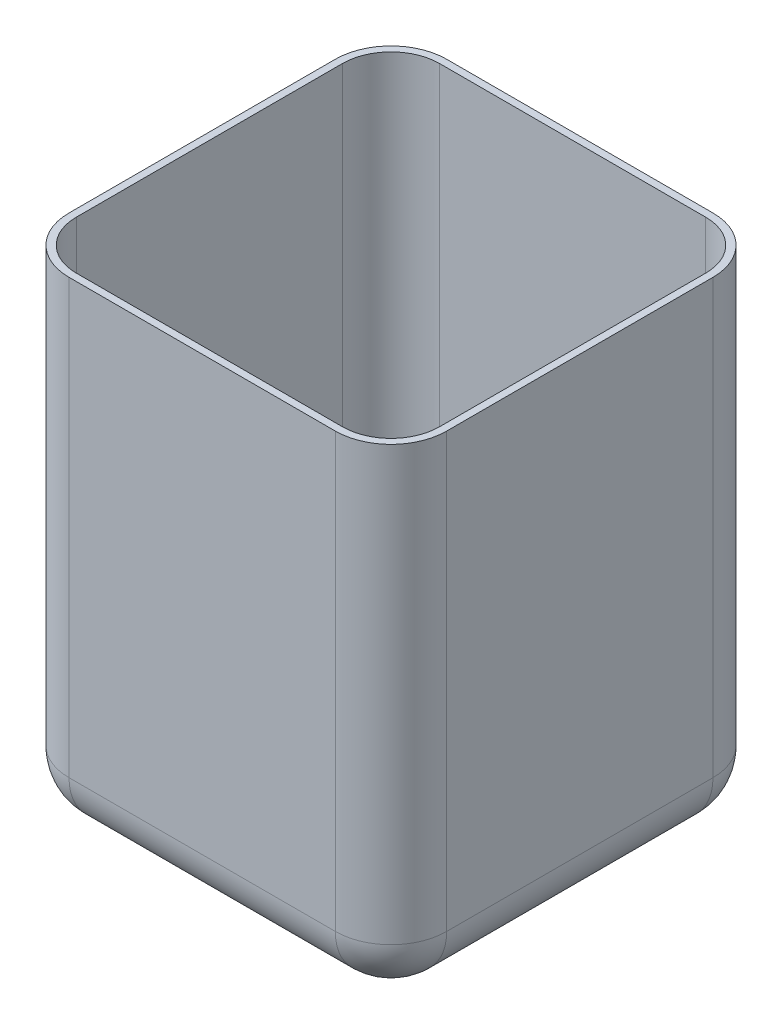
ISO-10303-21;
HEADER;
FILE_DESCRIPTION(('STEP AP214'),'2;1');
FILE_NAME('part.step','',(''),(''),'','','');
FILE_SCHEMA(('AUTOMOTIVE_DESIGN { 1 0 10303 214 1 1 1 1 }'));
ENDSEC;
DATA;
#1=APPLICATION_CONTEXT('core data for automotive mechanical design processes');
#2=APPLICATION_PROTOCOL_DEFINITION('international standard','automotive_design',2000,#1);
#3=PRODUCT_CONTEXT('',#1,'mechanical');
#4=PRODUCT('Part','Part','',(#3));
#5=PRODUCT_RELATED_PRODUCT_CATEGORY('part','',(#4));
#6=PRODUCT_DEFINITION_FORMATION('','',#4);
#7=PRODUCT_DEFINITION_CONTEXT('part definition',#1,'design');
#8=PRODUCT_DEFINITION('design','',#6,#7);
#9=PRODUCT_DEFINITION_SHAPE('','',#8);
#10=(LENGTH_UNIT() NAMED_UNIT(*) SI_UNIT(.MILLI.,.METRE.));
#11=(NAMED_UNIT(*) PLANE_ANGLE_UNIT() SI_UNIT($,.RADIAN.));
#12=(NAMED_UNIT(*) SI_UNIT($,.STERADIAN.) SOLID_ANGLE_UNIT());
#13=UNCERTAINTY_MEASURE_WITH_UNIT(LENGTH_MEASURE(1.E-05),#10,'distance_accuracy_value','');
#14=(GEOMETRIC_REPRESENTATION_CONTEXT(3) GLOBAL_UNCERTAINTY_ASSIGNED_CONTEXT((#13)) GLOBAL_UNIT_ASSIGNED_CONTEXT((#10,
#11,#12)) REPRESENTATION_CONTEXT('',''));
#15=CARTESIAN_POINT('',(0.,0.,0.));
#16=DIRECTION('',(0.,0.,1.));
#17=DIRECTION('',(1.,0.,0.));
#18=AXIS2_PLACEMENT_3D('',#15,#16,#17);
#19=CARTESIAN_POINT('',(-69.2307692307693,202.,-55.390243902439));
#20=DIRECTION('',(1.,0.,0.));
#21=DIRECTION('',(0.,0.,-1.));
#22=AXIS2_PLACEMENT_3D('',#19,#20,#21);
#23=PLANE('',#22);
#24=DIRECTION('',(0.,0.,1.));
#25=VECTOR('',#24,1.);
#26=CARTESIAN_POINT('',(-69.2307692307693,202.,-55.390243902439));
#27=LINE('',#26,#25);
#28=CARTESIAN_POINT('',(-69.2307692307693,202.,-32.390243902439));
#29=VERTEX_POINT('',#28);
#30=CARTESIAN_POINT('',(-69.2307692307692,202.,77.609756097561));
#31=VERTEX_POINT('',#30);
#32=EDGE_CURVE('E327',#29,#31,#27,.T.);
#33=ORIENTED_EDGE('',*,*,#32,.F.);
#34=DIRECTION('',(0.,-1.,0.));
#35=VECTOR('',#34,1.);
#36=CARTESIAN_POINT('',(-69.2307692307693,202.,-32.390243902439));
#37=LINE('',#36,#35);
#38=CARTESIAN_POINT('',(-69.2307692307693,23.,-32.390243902439));
#39=VERTEX_POINT('',#38);
#40=EDGE_CURVE('E71',#29,#39,#37,.T.);
#41=ORIENTED_EDGE('',*,*,#40,.T.);
#42=DIRECTION('',(0.,0.,1.));
#43=VECTOR('',#42,1.);
#44=CARTESIAN_POINT('',(-69.2307692307693,23.,-55.390243902439));
#45=LINE('',#44,#43);
#46=CARTESIAN_POINT('',(-69.2307692307692,23.,77.609756097561));
#47=VERTEX_POINT('',#46);
#48=EDGE_CURVE('E387',#39,#47,#45,.T.);
#49=ORIENTED_EDGE('',*,*,#48,.T.);
#50=DIRECTION('',(0.,-1.,0.));
#51=VECTOR('',#50,1.);
#52=CARTESIAN_POINT('',(-69.2307692307692,202.,77.609756097561));
#53=LINE('',#52,#51);
#54=EDGE_CURVE('E384',#47,#31,#53,.F.);
#55=ORIENTED_EDGE('',*,*,#54,.T.);
#56=EDGE_LOOP('',(#33,#41,#49,#55));
#57=FACE_BOUND('',#56,.T.);
#58=ADVANCED_FACE('F45',(#57),#23,.F.);
#59=CARTESIAN_POINT('',(-69.2307692307692,202.,100.609756097561));
#60=DIRECTION('',(0.,0.,-1.));
#61=DIRECTION('',(-1.,0.,0.));
#62=AXIS2_PLACEMENT_3D('',#59,#60,#61);
#63=PLANE('',#62);
#64=DIRECTION('',(1.,0.,0.));
#65=VECTOR('',#64,1.);
#66=CARTESIAN_POINT('',(-69.2307692307692,23.,100.609756097561));
#67=LINE('',#66,#65);
#68=CARTESIAN_POINT('',(-46.2307692307692,23.,100.609756097561));
#69=VERTEX_POINT('',#68);
#70=CARTESIAN_POINT('',(63.7692307692308,23.,100.609756097561));
#71=VERTEX_POINT('',#70);
#72=EDGE_CURVE('E346',#69,#71,#67,.T.);
#73=ORIENTED_EDGE('',*,*,#72,.T.);
#74=DIRECTION('',(0.,-1.,0.));
#75=VECTOR('',#74,1.);
#76=CARTESIAN_POINT('',(63.7692307692308,202.,100.609756097561));
#77=LINE('',#76,#75);
#78=CARTESIAN_POINT('',(63.7692307692308,202.,100.609756097561));
#79=VERTEX_POINT('',#78);
#80=EDGE_CURVE('E350',#71,#79,#77,.F.);
#81=ORIENTED_EDGE('',*,*,#80,.T.);
#82=DIRECTION('',(1.,0.,0.));
#83=VECTOR('',#82,1.);
#84=CARTESIAN_POINT('',(-69.2307692307692,202.,100.609756097561));
#85=LINE('',#84,#83);
#86=CARTESIAN_POINT('',(-46.2307692307692,202.,100.609756097561));
#87=VERTEX_POINT('',#86);
#88=EDGE_CURVE('E331',#87,#79,#85,.T.);
#89=ORIENTED_EDGE('',*,*,#88,.F.);
#90=DIRECTION('',(0.,-1.,0.));
#91=VECTOR('',#90,1.);
#92=CARTESIAN_POINT('',(-46.2307692307692,202.,100.609756097561));
#93=LINE('',#92,#91);
#94=EDGE_CURVE('E343',#87,#69,#93,.T.);
#95=ORIENTED_EDGE('',*,*,#94,.T.);
#96=EDGE_LOOP('',(#73,#81,#89,#95));
#97=FACE_BOUND('',#96,.T.);
#98=ADVANCED_FACE('F465',(#97),#63,.F.);
#99=CARTESIAN_POINT('',(86.7692307692307,202.,-55.390243902439));
#100=DIRECTION('',(-1.,0.,0.));
#101=DIRECTION('',(0.,0.,1.));
#102=AXIS2_PLACEMENT_3D('',#99,#100,#101);
#103=PLANE('',#102);
#104=DIRECTION('',(0.,0.,-1.));
#105=VECTOR('',#104,1.);
#106=CARTESIAN_POINT('',(86.7692307692307,23.,-55.390243902439));
#107=LINE('',#106,#105);
#108=CARTESIAN_POINT('',(86.7692307692308,23.,77.609756097561));
#109=VERTEX_POINT('',#108);
#110=CARTESIAN_POINT('',(86.7692307692307,23.,-32.390243902439));
#111=VERTEX_POINT('',#110);
#112=EDGE_CURVE('E369',#109,#111,#107,.T.);
#113=ORIENTED_EDGE('',*,*,#112,.T.);
#114=DIRECTION('',(0.,-1.,0.));
#115=VECTOR('',#114,1.);
#116=CARTESIAN_POINT('',(86.7692307692307,202.,-32.390243902439));
#117=LINE('',#116,#115);
#118=CARTESIAN_POINT('',(86.7692307692307,202.,-32.390243902439));
#119=VERTEX_POINT('',#118);
#120=EDGE_CURVE('E372',#111,#119,#117,.F.);
#121=ORIENTED_EDGE('',*,*,#120,.T.);
#122=DIRECTION('',(0.,0.,-1.));
#123=VECTOR('',#122,1.);
#124=CARTESIAN_POINT('',(86.7692307692307,202.,-55.390243902439));
#125=LINE('',#124,#123);
#126=CARTESIAN_POINT('',(86.7692307692308,202.,77.609756097561));
#127=VERTEX_POINT('',#126);
#128=EDGE_CURVE('E335',#127,#119,#125,.T.);
#129=ORIENTED_EDGE('',*,*,#128,.F.);
#130=DIRECTION('',(0.,-1.,0.));
#131=VECTOR('',#130,1.);
#132=CARTESIAN_POINT('',(86.7692307692308,202.,77.609756097561));
#133=LINE('',#132,#131);
#134=EDGE_CURVE('E366',#127,#109,#133,.T.);
#135=ORIENTED_EDGE('',*,*,#134,.T.);
#136=EDGE_LOOP('',(#113,#121,#129,#135));
#137=FACE_BOUND('',#136,.T.);
#138=ADVANCED_FACE('F475',(#137),#103,.F.);
#139=CARTESIAN_POINT('',(-69.2307692307693,202.,-55.390243902439));
#140=DIRECTION('',(0.,0.,1.));
#141=DIRECTION('',(1.,0.,0.));
#142=AXIS2_PLACEMENT_3D('',#139,#140,#141);
#143=PLANE('',#142);
#144=DIRECTION('',(-1.,0.,0.));
#145=VECTOR('',#144,1.);
#146=CARTESIAN_POINT('',(-69.2307692307693,202.,-55.390243902439));
#147=LINE('',#146,#145);
#148=CARTESIAN_POINT('',(63.7692307692308,202.,-55.390243902439));
#149=VERTEX_POINT('',#148);
#150=CARTESIAN_POINT('',(-46.2307692307692,202.,-55.390243902439));
#151=VERTEX_POINT('',#150);
#152=EDGE_CURVE('E339',#149,#151,#147,.T.);
#153=ORIENTED_EDGE('',*,*,#152,.F.);
#154=DIRECTION('',(0.,-1.,0.));
#155=VECTOR('',#154,1.);
#156=CARTESIAN_POINT('',(63.7692307692308,202.,-55.390243902439));
#157=LINE('',#156,#155);
#158=CARTESIAN_POINT('',(63.7692307692308,23.,-55.390243902439));
#159=VERTEX_POINT('',#158);
#160=EDGE_CURVE('E381',#149,#159,#157,.T.);
#161=ORIENTED_EDGE('',*,*,#160,.T.);
#162=DIRECTION('',(-1.,0.,0.));
#163=VECTOR('',#162,1.);
#164=CARTESIAN_POINT('',(-69.2307692307693,23.,-55.390243902439));
#165=LINE('',#164,#163);
#166=CARTESIAN_POINT('',(-46.2307692307692,23.,-55.390243902439));
#167=VERTEX_POINT('',#166);
#168=EDGE_CURVE('E378',#159,#167,#165,.T.);
#169=ORIENTED_EDGE('',*,*,#168,.T.);
#170=DIRECTION('',(0.,-1.,0.));
#171=VECTOR('',#170,1.);
#172=CARTESIAN_POINT('',(-46.2307692307692,202.,-55.390243902439));
#173=LINE('',#172,#171);
#174=EDGE_CURVE('E375',#167,#151,#173,.F.);
#175=ORIENTED_EDGE('',*,*,#174,.T.);
#176=EDGE_LOOP('',(#153,#161,#169,#175));
#177=FACE_BOUND('',#176,.T.);
#178=ADVANCED_FACE('F497',(#177),#143,.F.);
#179=CARTESIAN_POINT('',(0.,202.,0.));
#180=DIRECTION('',(0.,1.,0.));
#181=DIRECTION('',(0.,0.,1.));
#182=AXIS2_PLACEMENT_3D('',#179,#180,#181);
#183=PLANE('',#182);
#184=DIRECTION('',(0.,0.,-1.));
#185=VECTOR('',#184,1.);
#186=CARTESIAN_POINT('',(83.7692307692307,202.,-55.390243902439));
#187=LINE('',#186,#185);
#188=CARTESIAN_POINT('',(83.7692307692308,202.,77.609756097561));
#189=VERTEX_POINT('',#188);
#190=CARTESIAN_POINT('',(83.7692307692307,202.,-32.390243902439));
#191=VERTEX_POINT('',#190);
#192=EDGE_CURVE('E312',#189,#191,#187,.T.);
#193=ORIENTED_EDGE('',*,*,#192,.F.);
#194=CARTESIAN_POINT('',(63.7692307692308,202.,77.609756097561));
#195=DIRECTION('',(0.,1.,0.));
#196=DIRECTION('',(0.,0.,1.));
#197=AXIS2_PLACEMENT_3D('',#194,#195,#196);
#198=CIRCLE('',#197,20.);
#199=CARTESIAN_POINT('',(63.7692307692308,202.,97.6097560975609));
#200=VERTEX_POINT('',#199);
#201=EDGE_CURVE('E309',#200,#189,#198,.T.);
#202=ORIENTED_EDGE('',*,*,#201,.F.);
#203=DIRECTION('',(1.,0.,0.));
#204=VECTOR('',#203,1.);
#205=CARTESIAN_POINT('',(-69.2307692307692,202.,97.6097560975609));
#206=LINE('',#205,#204);
#207=CARTESIAN_POINT('',(-46.2307692307692,202.,97.6097560975609));
#208=VERTEX_POINT('',#207);
#209=EDGE_CURVE('E63',#208,#200,#206,.T.);
#210=ORIENTED_EDGE('',*,*,#209,.F.);
#211=CARTESIAN_POINT('',(-46.2307692307692,202.,77.609756097561));
#212=DIRECTION('',(0.,1.,0.));
#213=DIRECTION('',(0.,0.,1.));
#214=AXIS2_PLACEMENT_3D('',#211,#212,#213);
#215=CIRCLE('',#214,20.);
#216=CARTESIAN_POINT('',(-66.2307692307692,202.,77.609756097561));
#217=VERTEX_POINT('',#216);
#218=EDGE_CURVE('E198',#217,#208,#215,.T.);
#219=ORIENTED_EDGE('',*,*,#218,.F.);
#220=DIRECTION('',(0.,0.,1.));
#221=VECTOR('',#220,1.);
#222=CARTESIAN_POINT('',(-66.2307692307692,202.,-55.390243902439));
#223=LINE('',#222,#221);
#224=CARTESIAN_POINT('',(-66.2307692307692,202.,-32.390243902439));
#225=VERTEX_POINT('',#224);
#226=EDGE_CURVE('E273',#225,#217,#223,.T.);
#227=ORIENTED_EDGE('',*,*,#226,.F.);
#228=CARTESIAN_POINT('',(-46.2307692307692,202.,-32.390243902439));
#229=DIRECTION('',(0.,1.,0.));
#230=DIRECTION('',(0.,0.,1.));
#231=AXIS2_PLACEMENT_3D('',#228,#229,#230);
#232=CIRCLE('',#231,20.);
#233=CARTESIAN_POINT('',(-46.2307692307692,202.,-52.390243902439));
#234=VERTEX_POINT('',#233);
#235=EDGE_CURVE('E192',#234,#225,#232,.T.);
#236=ORIENTED_EDGE('',*,*,#235,.F.);
#237=DIRECTION('',(-1.,0.,0.));
#238=VECTOR('',#237,1.);
#239=CARTESIAN_POINT('',(-69.2307692307693,202.,-52.390243902439));
#240=LINE('',#239,#238);
#241=CARTESIAN_POINT('',(63.7692307692308,202.,-52.390243902439));
#242=VERTEX_POINT('',#241);
#243=EDGE_CURVE('E286',#242,#234,#240,.T.);
#244=ORIENTED_EDGE('',*,*,#243,.F.);
#245=CARTESIAN_POINT('',(63.7692307692308,202.,-32.390243902439));
#246=DIRECTION('',(0.,1.,0.));
#247=DIRECTION('',(0.,0.,1.));
#248=AXIS2_PLACEMENT_3D('',#245,#246,#247);
#249=CIRCLE('',#248,20.);
#250=EDGE_CURVE('E318',#191,#242,#249,.T.);
#251=ORIENTED_EDGE('',*,*,#250,.F.);
#252=EDGE_LOOP('',(#193,#202,#210,#219,#227,#236,#244,#251));
#253=FACE_BOUND('',#252,.T.);
#254=ORIENTED_EDGE('',*,*,#128,.T.);
#255=CARTESIAN_POINT('',(63.7692307692308,202.,-32.390243902439));
#256=DIRECTION('',(0.,1.,0.));
#257=DIRECTION('',(0.,0.,1.));
#258=AXIS2_PLACEMENT_3D('',#255,#256,#257);
#259=CIRCLE('',#258,23.);
#260=EDGE_CURVE('E11',#119,#149,#259,.T.);
#261=ORIENTED_EDGE('',*,*,#260,.T.);
#262=ORIENTED_EDGE('',*,*,#152,.T.);
#263=CARTESIAN_POINT('',(-46.2307692307692,202.,-32.390243902439));
#264=DIRECTION('',(0.,1.,0.));
#265=DIRECTION('',(0.,0.,1.));
#266=AXIS2_PLACEMENT_3D('',#263,#264,#265);
#267=CIRCLE('',#266,23.);
#268=EDGE_CURVE('E55',#151,#29,#267,.T.);
#269=ORIENTED_EDGE('',*,*,#268,.T.);
#270=ORIENTED_EDGE('',*,*,#32,.T.);
#271=CARTESIAN_POINT('',(-46.2307692307692,202.,77.609756097561));
#272=DIRECTION('',(0.,1.,0.));
#273=DIRECTION('',(0.,0.,1.));
#274=AXIS2_PLACEMENT_3D('',#271,#272,#273);
#275=CIRCLE('',#274,23.);
#276=EDGE_CURVE('E392',#31,#87,#275,.T.);
#277=ORIENTED_EDGE('',*,*,#276,.T.);
#278=ORIENTED_EDGE('',*,*,#88,.T.);
#279=CARTESIAN_POINT('',(63.7692307692308,202.,77.609756097561));
#280=DIRECTION('',(0.,1.,0.));
#281=DIRECTION('',(0.,0.,1.));
#282=AXIS2_PLACEMENT_3D('',#279,#280,#281);
#283=CIRCLE('',#282,23.);
#284=EDGE_CURVE('E395',#79,#127,#283,.T.);
#285=ORIENTED_EDGE('',*,*,#284,.T.);
#286=EDGE_LOOP('',(#254,#261,#262,#269,#270,#277,#278,#285));
#287=FACE_BOUND('',#286,.T.);
#288=ADVANCED_FACE('F462',(#253,#287),#183,.T.);
#289=CARTESIAN_POINT('',(0.,0.,0.));
#290=DIRECTION('',(0.,1.,0.));
#291=DIRECTION('',(0.,0.,1.));
#292=AXIS2_PLACEMENT_3D('',#289,#290,#291);
#293=PLANE('',#292);
#294=DIRECTION('',(0.,0.,-1.));
#295=VECTOR('',#294,1.);
#296=CARTESIAN_POINT('',(63.7692307692307,0.,0.));
#297=LINE('',#296,#295);
#298=CARTESIAN_POINT('',(63.7692307692307,0.,-32.390243902439));
#299=VERTEX_POINT('',#298);
#300=CARTESIAN_POINT('',(63.7692307692308,0.,77.609756097561));
#301=VERTEX_POINT('',#300);
#302=EDGE_CURVE('E359',#299,#301,#297,.F.);
#303=ORIENTED_EDGE('',*,*,#302,.T.);
#304=DIRECTION('',(1.,0.,0.));
#305=VECTOR('',#304,1.);
#306=CARTESIAN_POINT('',(0.,0.,77.609756097561));
#307=LINE('',#306,#305);
#308=CARTESIAN_POINT('',(-46.2307692307692,0.,77.609756097561));
#309=VERTEX_POINT('',#308);
#310=EDGE_CURVE('E362',#301,#309,#307,.F.);
#311=ORIENTED_EDGE('',*,*,#310,.T.);
#312=DIRECTION('',(0.,0.,1.));
#313=VECTOR('',#312,1.);
#314=CARTESIAN_POINT('',(-46.2307692307692,0.,0.));
#315=LINE('',#314,#313);
#316=CARTESIAN_POINT('',(-46.2307692307692,0.,-32.390243902439));
#317=VERTEX_POINT('',#316);
#318=EDGE_CURVE('E353',#309,#317,#315,.F.);
#319=ORIENTED_EDGE('',*,*,#318,.T.);
#320=DIRECTION('',(-1.,0.,0.));
#321=VECTOR('',#320,1.);
#322=CARTESIAN_POINT('',(0.,0.,-32.390243902439));
#323=LINE('',#322,#321);
#324=EDGE_CURVE('E356',#317,#299,#323,.F.);
#325=ORIENTED_EDGE('',*,*,#324,.T.);
#326=EDGE_LOOP('',(#303,#311,#319,#325));
#327=FACE_BOUND('',#326,.T.);
#328=ADVANCED_FACE('F492',(#327),#293,.F.);
#329=CARTESIAN_POINT('',(-46.2307692307692,202.,-32.390243902439));
#330=DIRECTION('',(0.,-1.,0.));
#331=DIRECTION('',(0.,0.,-1.));
#332=AXIS2_PLACEMENT_3D('',#329,#330,#331);
#333=CYLINDRICAL_SURFACE('',#332,23.);
#334=ORIENTED_EDGE('',*,*,#268,.F.);
#335=ORIENTED_EDGE('',*,*,#174,.F.);
#336=CARTESIAN_POINT('',(-46.2307692307692,23.,-32.390243902439));
#337=DIRECTION('',(0.,-1.,0.));
#338=DIRECTION('',(0.,0.,-1.));
#339=AXIS2_PLACEMENT_3D('',#336,#337,#338);
#340=CIRCLE('',#339,23.);
#341=EDGE_CURVE('E436',#39,#167,#340,.T.);
#342=ORIENTED_EDGE('',*,*,#341,.F.);
#343=ORIENTED_EDGE('',*,*,#40,.F.);
#344=EDGE_LOOP('',(#334,#335,#342,#343));
#345=FACE_BOUND('',#344,.T.);
#346=ADVANCED_FACE('F47',(#345),#333,.T.);
#347=CARTESIAN_POINT('',(63.7692307692308,202.,-32.390243902439));
#348=DIRECTION('',(0.,-1.,0.));
#349=DIRECTION('',(0.,0.,-1.));
#350=AXIS2_PLACEMENT_3D('',#347,#348,#349);
#351=CYLINDRICAL_SURFACE('',#350,23.);
#352=ORIENTED_EDGE('',*,*,#260,.F.);
#353=ORIENTED_EDGE('',*,*,#120,.F.);
#354=CARTESIAN_POINT('',(63.7692307692308,23.,-32.390243902439));
#355=DIRECTION('',(0.,-1.,0.));
#356=DIRECTION('',(0.,0.,-1.));
#357=AXIS2_PLACEMENT_3D('',#354,#355,#356);
#358=CIRCLE('',#357,23.);
#359=EDGE_CURVE('E433',#159,#111,#358,.T.);
#360=ORIENTED_EDGE('',*,*,#359,.F.);
#361=ORIENTED_EDGE('',*,*,#160,.F.);
#362=EDGE_LOOP('',(#352,#353,#360,#361));
#363=FACE_BOUND('',#362,.T.);
#364=ADVANCED_FACE('F480',(#363),#351,.T.);
#365=CARTESIAN_POINT('',(-69.2307692307693,23.,-32.390243902439));
#366=DIRECTION('',(-1.,0.,0.));
#367=DIRECTION('',(0.,0.,1.));
#368=AXIS2_PLACEMENT_3D('',#365,#366,#367);
#369=CYLINDRICAL_SURFACE('',#368,23.);
#370=CARTESIAN_POINT('',(-46.2307692307692,23.,-32.390243902439));
#371=DIRECTION('',(-1.,0.,0.));
#372=DIRECTION('',(0.,0.,1.));
#373=AXIS2_PLACEMENT_3D('',#370,#371,#372);
#374=CIRCLE('',#373,23.);
#375=EDGE_CURVE('E49',#167,#317,#374,.T.);
#376=ORIENTED_EDGE('',*,*,#375,.F.);
#377=ORIENTED_EDGE('',*,*,#168,.F.);
#378=CARTESIAN_POINT('',(63.7692307692307,23.,-32.390243902439));
#379=DIRECTION('',(1.,0.,0.));
#380=DIRECTION('',(0.,0.,-1.));
#381=AXIS2_PLACEMENT_3D('',#378,#379,#380);
#382=CIRCLE('',#381,23.);
#383=EDGE_CURVE('E429',#299,#159,#382,.T.);
#384=ORIENTED_EDGE('',*,*,#383,.F.);
#385=ORIENTED_EDGE('',*,*,#324,.F.);
#386=EDGE_LOOP('',(#376,#377,#384,#385));
#387=FACE_BOUND('',#386,.T.);
#388=ADVANCED_FACE('F493',(#387),#369,.T.);
#389=CARTESIAN_POINT('',(-46.2307692307692,23.,-32.390243902439));
#390=DIRECTION('',(0.,0.,-1.));
#391=DIRECTION('',(0.,1.,0.));
#392=AXIS2_PLACEMENT_3D('',#389,#390,#391);
#393=SPHERICAL_SURFACE('',#392,23.);
#394=ORIENTED_EDGE('',*,*,#341,.T.);
#395=ORIENTED_EDGE('',*,*,#375,.T.);
#396=CARTESIAN_POINT('',(-46.2307692307692,23.,-32.390243902439));
#397=DIRECTION('',(0.,0.,-1.));
#398=DIRECTION('',(-1.,0.,0.));
#399=AXIS2_PLACEMENT_3D('',#396,#397,#398);
#400=CIRCLE('',#399,23.);
#401=EDGE_CURVE('E425',#39,#317,#400,.F.);
#402=ORIENTED_EDGE('',*,*,#401,.F.);
#403=EDGE_LOOP('',(#394,#395,#402));
#404=FACE_BOUND('',#403,.T.);
#405=ADVANCED_FACE('F444',(#404),#393,.T.);
#406=CARTESIAN_POINT('',(63.7692307692307,23.,-32.390243902439));
#407=DIRECTION('',(0.,0.,-1.));
#408=DIRECTION('',(-1.,0.,0.));
#409=AXIS2_PLACEMENT_3D('',#406,#407,#408);
#410=SPHERICAL_SURFACE('',#409,23.);
#411=ORIENTED_EDGE('',*,*,#383,.T.);
#412=ORIENTED_EDGE('',*,*,#359,.T.);
#413=CARTESIAN_POINT('',(63.7692307692307,23.,-32.390243902439));
#414=DIRECTION('',(0.,0.,-1.));
#415=DIRECTION('',(-1.,0.,0.));
#416=AXIS2_PLACEMENT_3D('',#413,#414,#415);
#417=CIRCLE('',#416,23.);
#418=EDGE_CURVE('E421',#299,#111,#417,.F.);
#419=ORIENTED_EDGE('',*,*,#418,.F.);
#420=EDGE_LOOP('',(#411,#412,#419));
#421=FACE_BOUND('',#420,.T.);
#422=ADVANCED_FACE('F484',(#421),#410,.T.);
#423=CARTESIAN_POINT('',(-46.2307692307692,23.,-55.390243902439));
#424=DIRECTION('',(0.,0.,1.));
#425=DIRECTION('',(1.,0.,0.));
#426=AXIS2_PLACEMENT_3D('',#423,#424,#425);
#427=CYLINDRICAL_SURFACE('',#426,23.);
#428=ORIENTED_EDGE('',*,*,#401,.T.);
#429=ORIENTED_EDGE('',*,*,#318,.F.);
#430=CARTESIAN_POINT('',(-46.2307692307692,23.,77.609756097561));
#431=DIRECTION('',(0.,0.,1.));
#432=DIRECTION('',(1.,0.,0.));
#433=AXIS2_PLACEMENT_3D('',#430,#431,#432);
#434=CIRCLE('',#433,23.);
#435=EDGE_CURVE('E417',#47,#309,#434,.T.);
#436=ORIENTED_EDGE('',*,*,#435,.F.);
#437=ORIENTED_EDGE('',*,*,#48,.F.);
#438=EDGE_LOOP('',(#428,#429,#436,#437));
#439=FACE_BOUND('',#438,.T.);
#440=ADVANCED_FACE('F451',(#439),#427,.T.);
#441=CARTESIAN_POINT('',(-46.2307692307692,202.,77.609756097561));
#442=DIRECTION('',(0.,-1.,0.));
#443=DIRECTION('',(0.,0.,-1.));
#444=AXIS2_PLACEMENT_3D('',#441,#442,#443);
#445=CYLINDRICAL_SURFACE('',#444,23.);
#446=ORIENTED_EDGE('',*,*,#276,.F.);
#447=ORIENTED_EDGE('',*,*,#54,.F.);
#448=CARTESIAN_POINT('',(-46.2307692307692,23.,77.609756097561));
#449=DIRECTION('',(0.,-1.,0.));
#450=DIRECTION('',(0.,0.,-1.));
#451=AXIS2_PLACEMENT_3D('',#448,#449,#450);
#452=CIRCLE('',#451,23.);
#453=EDGE_CURVE('E413',#69,#47,#452,.T.);
#454=ORIENTED_EDGE('',*,*,#453,.F.);
#455=ORIENTED_EDGE('',*,*,#94,.F.);
#456=EDGE_LOOP('',(#446,#447,#454,#455));
#457=FACE_BOUND('',#456,.T.);
#458=ADVANCED_FACE('F457',(#457),#445,.T.);
#459=CARTESIAN_POINT('',(63.7692307692308,202.,77.609756097561));
#460=DIRECTION('',(0.,-1.,0.));
#461=DIRECTION('',(0.,0.,-1.));
#462=AXIS2_PLACEMENT_3D('',#459,#460,#461);
#463=CYLINDRICAL_SURFACE('',#462,23.);
#464=ORIENTED_EDGE('',*,*,#284,.F.);
#465=ORIENTED_EDGE('',*,*,#80,.F.);
#466=CARTESIAN_POINT('',(63.7692307692308,23.,77.609756097561));
#467=DIRECTION('',(0.,-1.,0.));
#468=DIRECTION('',(0.,0.,-1.));
#469=AXIS2_PLACEMENT_3D('',#466,#467,#468);
#470=CIRCLE('',#469,23.);
#471=EDGE_CURVE('E409',#109,#71,#470,.T.);
#472=ORIENTED_EDGE('',*,*,#471,.F.);
#473=ORIENTED_EDGE('',*,*,#134,.F.);
#474=EDGE_LOOP('',(#464,#465,#472,#473));
#475=FACE_BOUND('',#474,.T.);
#476=ADVANCED_FACE('F470',(#475),#463,.T.);
#477=CARTESIAN_POINT('',(63.7692307692307,23.,-55.390243902439));
#478=DIRECTION('',(0.,0.,-1.));
#479=DIRECTION('',(-1.,0.,0.));
#480=AXIS2_PLACEMENT_3D('',#477,#478,#479);
#481=CYLINDRICAL_SURFACE('',#480,23.);
#482=ORIENTED_EDGE('',*,*,#418,.T.);
#483=ORIENTED_EDGE('',*,*,#112,.F.);
#484=CARTESIAN_POINT('',(63.7692307692308,23.,77.609756097561));
#485=DIRECTION('',(0.,0.,1.));
#486=DIRECTION('',(1.,0.,0.));
#487=AXIS2_PLACEMENT_3D('',#484,#485,#486);
#488=CIRCLE('',#487,23.);
#489=EDGE_CURVE('E405',#301,#109,#488,.T.);
#490=ORIENTED_EDGE('',*,*,#489,.F.);
#491=ORIENTED_EDGE('',*,*,#302,.F.);
#492=EDGE_LOOP('',(#482,#483,#490,#491));
#493=FACE_BOUND('',#492,.T.);
#494=ADVANCED_FACE('F488',(#493),#481,.T.);
#495=CARTESIAN_POINT('',(-46.2307692307692,23.,77.609756097561));
#496=DIRECTION('',(-1.,0.,0.));
#497=DIRECTION('',(0.,-1.,0.));
#498=AXIS2_PLACEMENT_3D('',#495,#496,#497);
#499=SPHERICAL_SURFACE('',#498,23.);
#500=ORIENTED_EDGE('',*,*,#453,.T.);
#501=ORIENTED_EDGE('',*,*,#435,.T.);
#502=CARTESIAN_POINT('',(-46.2307692307692,23.,77.609756097561));
#503=DIRECTION('',(-1.,0.,0.));
#504=DIRECTION('',(0.,0.,1.));
#505=AXIS2_PLACEMENT_3D('',#502,#503,#504);
#506=CIRCLE('',#505,23.);
#507=EDGE_CURVE('E402',#69,#309,#506,.F.);
#508=ORIENTED_EDGE('',*,*,#507,.F.);
#509=EDGE_LOOP('',(#500,#501,#508));
#510=FACE_BOUND('',#509,.T.);
#511=ADVANCED_FACE('F521',(#510),#499,.T.);
#512=CARTESIAN_POINT('',(63.7692307692308,23.,77.609756097561));
#513=DIRECTION('',(1.,0.,0.));
#514=DIRECTION('',(0.,1.,0.));
#515=AXIS2_PLACEMENT_3D('',#512,#513,#514);
#516=SPHERICAL_SURFACE('',#515,23.);
#517=ORIENTED_EDGE('',*,*,#489,.T.);
#518=ORIENTED_EDGE('',*,*,#471,.T.);
#519=CARTESIAN_POINT('',(63.7692307692308,23.,77.609756097561));
#520=DIRECTION('',(1.,0.,0.));
#521=DIRECTION('',(0.,0.,-1.));
#522=AXIS2_PLACEMENT_3D('',#519,#520,#521);
#523=CIRCLE('',#522,23.);
#524=EDGE_CURVE('E321',#301,#71,#523,.F.);
#525=ORIENTED_EDGE('',*,*,#524,.F.);
#526=EDGE_LOOP('',(#517,#518,#525));
#527=FACE_BOUND('',#526,.T.);
#528=ADVANCED_FACE('F517',(#527),#516,.T.);
#529=CARTESIAN_POINT('',(-69.2307692307692,23.,77.609756097561));
#530=DIRECTION('',(1.,0.,0.));
#531=DIRECTION('',(0.,0.,-1.));
#532=AXIS2_PLACEMENT_3D('',#529,#530,#531);
#533=CYLINDRICAL_SURFACE('',#532,23.);
#534=ORIENTED_EDGE('',*,*,#507,.T.);
#535=ORIENTED_EDGE('',*,*,#310,.F.);
#536=ORIENTED_EDGE('',*,*,#524,.T.);
#537=ORIENTED_EDGE('',*,*,#72,.F.);
#538=EDGE_LOOP('',(#534,#535,#536,#537));
#539=FACE_BOUND('',#538,.T.);
#540=ADVANCED_FACE('F514',(#539),#533,.T.);
#541=CARTESIAN_POINT('',(-66.2307692307692,202.,-55.390243902439));
#542=DIRECTION('',(1.,0.,0.));
#543=DIRECTION('',(0.,0.,-1.));
#544=AXIS2_PLACEMENT_3D('',#541,#542,#543);
#545=PLANE('',#544);
#546=ORIENTED_EDGE('',*,*,#226,.T.);
#547=DIRECTION('',(0.,1.,0.));
#548=VECTOR('',#547,1.);
#549=CARTESIAN_POINT('',(-66.2307692307692,202.,77.609756097561));
#550=LINE('',#549,#548);
#551=CARTESIAN_POINT('',(-66.2307692307692,23.,77.609756097561));
#552=VERTEX_POINT('',#551);
#553=EDGE_CURVE('E224',#552,#217,#550,.T.);
#554=ORIENTED_EDGE('',*,*,#553,.F.);
#555=DIRECTION('',(0.,0.,-1.));
#556=VECTOR('',#555,1.);
#557=CARTESIAN_POINT('',(-66.2307692307692,23.,-55.390243902439));
#558=LINE('',#557,#556);
#559=CARTESIAN_POINT('',(-66.2307692307692,23.,-32.390243902439));
#560=VERTEX_POINT('',#559);
#561=EDGE_CURVE('E199',#560,#552,#558,.F.);
#562=ORIENTED_EDGE('',*,*,#561,.F.);
#563=DIRECTION('',(0.,1.,0.));
#564=VECTOR('',#563,1.);
#565=CARTESIAN_POINT('',(-66.2307692307692,202.,-32.390243902439));
#566=LINE('',#565,#564);
#567=EDGE_CURVE('E187',#225,#560,#566,.F.);
#568=ORIENTED_EDGE('',*,*,#567,.F.);
#569=EDGE_LOOP('',(#546,#554,#562,#568));
#570=FACE_BOUND('',#569,.T.);
#571=ADVANCED_FACE('F223',(#570),#545,.T.);
#572=CARTESIAN_POINT('',(-69.2307692307692,202.,97.6097560975609));
#573=DIRECTION('',(0.,0.,-1.));
#574=DIRECTION('',(-1.,0.,0.));
#575=AXIS2_PLACEMENT_3D('',#572,#573,#574);
#576=PLANE('',#575);
#577=DIRECTION('',(-1.,0.,0.));
#578=VECTOR('',#577,1.);
#579=CARTESIAN_POINT('',(-69.2307692307692,23.,97.6097560975609));
#580=LINE('',#579,#578);
#581=CARTESIAN_POINT('',(-46.2307692307692,23.,97.6097560975609));
#582=VERTEX_POINT('',#581);
#583=CARTESIAN_POINT('',(63.7692307692308,23.,97.609756097561));
#584=VERTEX_POINT('',#583);
#585=EDGE_CURVE('E285',#582,#584,#580,.F.);
#586=ORIENTED_EDGE('',*,*,#585,.F.);
#587=DIRECTION('',(0.,1.,0.));
#588=VECTOR('',#587,1.);
#589=CARTESIAN_POINT('',(-46.2307692307692,202.,97.6097560975609));
#590=LINE('',#589,#588);
#591=EDGE_CURVE('E282',#208,#582,#590,.F.);
#592=ORIENTED_EDGE('',*,*,#591,.F.);
#593=ORIENTED_EDGE('',*,*,#209,.T.);
#594=DIRECTION('',(0.,1.,0.));
#595=VECTOR('',#594,1.);
#596=CARTESIAN_POINT('',(63.7692307692308,202.,97.6097560975609));
#597=LINE('',#596,#595);
#598=EDGE_CURVE('E269',#584,#200,#597,.T.);
#599=ORIENTED_EDGE('',*,*,#598,.F.);
#600=EDGE_LOOP('',(#586,#592,#593,#599));
#601=FACE_BOUND('',#600,.T.);
#602=ADVANCED_FACE('F586',(#601),#576,.T.);
#603=CARTESIAN_POINT('',(83.7692307692307,202.,-55.390243902439));
#604=DIRECTION('',(-1.,0.,0.));
#605=DIRECTION('',(0.,0.,1.));
#606=AXIS2_PLACEMENT_3D('',#603,#604,#605);
#607=PLANE('',#606);
#608=DIRECTION('',(0.,0.,1.));
#609=VECTOR('',#608,1.);
#610=CARTESIAN_POINT('',(83.7692307692307,23.,-55.390243902439));
#611=LINE('',#610,#609);
#612=CARTESIAN_POINT('',(83.7692307692308,23.,77.609756097561));
#613=VERTEX_POINT('',#612);
#614=CARTESIAN_POINT('',(83.7692307692307,23.,-32.390243902439));
#615=VERTEX_POINT('',#614);
#616=EDGE_CURVE('E243',#613,#615,#611,.F.);
#617=ORIENTED_EDGE('',*,*,#616,.F.);
#618=DIRECTION('',(0.,1.,0.));
#619=VECTOR('',#618,1.);
#620=CARTESIAN_POINT('',(83.7692307692308,202.,77.609756097561));
#621=LINE('',#620,#619);
#622=EDGE_CURVE('E249',#189,#613,#621,.F.);
#623=ORIENTED_EDGE('',*,*,#622,.F.);
#624=ORIENTED_EDGE('',*,*,#192,.T.);
#625=DIRECTION('',(0.,1.,0.));
#626=VECTOR('',#625,1.);
#627=CARTESIAN_POINT('',(83.7692307692307,202.,-32.390243902439));
#628=LINE('',#627,#626);
#629=EDGE_CURVE('E235',#615,#191,#628,.T.);
#630=ORIENTED_EDGE('',*,*,#629,.F.);
#631=EDGE_LOOP('',(#617,#623,#624,#630));
#632=FACE_BOUND('',#631,.T.);
#633=ADVANCED_FACE('F593',(#632),#607,.T.);
#634=CARTESIAN_POINT('',(-69.2307692307693,202.,-52.390243902439));
#635=DIRECTION('',(0.,0.,1.));
#636=DIRECTION('',(1.,0.,0.));
#637=AXIS2_PLACEMENT_3D('',#634,#635,#636);
#638=PLANE('',#637);
#639=ORIENTED_EDGE('',*,*,#243,.T.);
#640=DIRECTION('',(0.,1.,0.));
#641=VECTOR('',#640,1.);
#642=CARTESIAN_POINT('',(-46.2307692307692,202.,-52.390243902439));
#643=LINE('',#642,#641);
#644=CARTESIAN_POINT('',(-46.2307692307692,23.,-52.390243902439));
#645=VERTEX_POINT('',#644);
#646=EDGE_CURVE('E232',#645,#234,#643,.T.);
#647=ORIENTED_EDGE('',*,*,#646,.F.);
#648=DIRECTION('',(1.,0.,0.));
#649=VECTOR('',#648,1.);
#650=CARTESIAN_POINT('',(-69.2307692307693,23.,-52.390243902439));
#651=LINE('',#650,#649);
#652=CARTESIAN_POINT('',(63.7692307692308,23.,-52.390243902439));
#653=VERTEX_POINT('',#652);
#654=EDGE_CURVE('E234',#653,#645,#651,.F.);
#655=ORIENTED_EDGE('',*,*,#654,.F.);
#656=DIRECTION('',(0.,1.,0.));
#657=VECTOR('',#656,1.);
#658=CARTESIAN_POINT('',(63.7692307692308,202.,-52.390243902439));
#659=LINE('',#658,#657);
#660=EDGE_CURVE('E229',#242,#653,#659,.F.);
#661=ORIENTED_EDGE('',*,*,#660,.F.);
#662=EDGE_LOOP('',(#639,#647,#655,#661));
#663=FACE_BOUND('',#662,.T.);
#664=ADVANCED_FACE('F600',(#663),#638,.T.);
#665=CARTESIAN_POINT('',(0.,3.,0.));
#666=DIRECTION('',(0.,1.,0.));
#667=DIRECTION('',(0.,0.,1.));
#668=AXIS2_PLACEMENT_3D('',#665,#666,#667);
#669=PLANE('',#668);
#670=DIRECTION('',(0.,0.,1.));
#671=VECTOR('',#670,1.);
#672=CARTESIAN_POINT('',(63.7692307692307,3.,0.));
#673=LINE('',#672,#671);
#674=CARTESIAN_POINT('',(63.7692307692307,3.,-32.390243902439));
#675=VERTEX_POINT('',#674);
#676=CARTESIAN_POINT('',(63.7692307692308,3.,77.609756097561));
#677=VERTEX_POINT('',#676);
#678=EDGE_CURVE('E260',#675,#677,#673,.T.);
#679=ORIENTED_EDGE('',*,*,#678,.F.);
#680=DIRECTION('',(1.,0.,0.));
#681=VECTOR('',#680,1.);
#682=CARTESIAN_POINT('',(0.,3.,-32.390243902439));
#683=LINE('',#682,#681);
#684=CARTESIAN_POINT('',(-46.2307692307692,3.,-32.390243902439));
#685=VERTEX_POINT('',#684);
#686=EDGE_CURVE('E263',#685,#675,#683,.T.);
#687=ORIENTED_EDGE('',*,*,#686,.F.);
#688=DIRECTION('',(0.,0.,1.));
#689=VECTOR('',#688,1.);
#690=CARTESIAN_POINT('',(-46.2307692307692,3.,0.));
#691=LINE('',#690,#689);
#692=CARTESIAN_POINT('',(-46.2307692307692,2.99999999999999,77.609756097561));
#693=VERTEX_POINT('',#692);
#694=EDGE_CURVE('E217',#693,#685,#691,.F.);
#695=ORIENTED_EDGE('',*,*,#694,.F.);
#696=DIRECTION('',(1.,0.,0.));
#697=VECTOR('',#696,1.);
#698=CARTESIAN_POINT('',(0.,3.,77.609756097561));
#699=LINE('',#698,#697);
#700=EDGE_CURVE('E252',#677,#693,#699,.F.);
#701=ORIENTED_EDGE('',*,*,#700,.F.);
#702=EDGE_LOOP('',(#679,#687,#695,#701));
#703=FACE_BOUND('',#702,.T.);
#704=ADVANCED_FACE('F608',(#703),#669,.T.);
#705=CARTESIAN_POINT('',(-46.2307692307692,202.,-32.390243902439));
#706=DIRECTION('',(0.,-1.,0.));
#707=DIRECTION('',(0.,0.,-1.));
#708=AXIS2_PLACEMENT_3D('',#705,#706,#707);
#709=CYLINDRICAL_SURFACE('',#708,20.);
#710=ORIENTED_EDGE('',*,*,#235,.T.);
#711=ORIENTED_EDGE('',*,*,#567,.T.);
#712=CARTESIAN_POINT('',(-46.2307692307692,23.,-32.390243902439));
#713=DIRECTION('',(0.,-1.,0.));
#714=DIRECTION('',(0.,0.,-1.));
#715=AXIS2_PLACEMENT_3D('',#712,#713,#714);
#716=CIRCLE('',#715,20.);
#717=EDGE_CURVE('E190',#560,#645,#716,.T.);
#718=ORIENTED_EDGE('',*,*,#717,.T.);
#719=ORIENTED_EDGE('',*,*,#646,.T.);
#720=EDGE_LOOP('',(#710,#711,#718,#719));
#721=FACE_BOUND('',#720,.T.);
#722=ADVANCED_FACE('F189',(#721),#709,.F.);
#723=CARTESIAN_POINT('',(63.7692307692308,202.,-32.390243902439));
#724=DIRECTION('',(0.,-1.,0.));
#725=DIRECTION('',(0.,0.,-1.));
#726=AXIS2_PLACEMENT_3D('',#723,#724,#725);
#727=CYLINDRICAL_SURFACE('',#726,20.);
#728=ORIENTED_EDGE('',*,*,#250,.T.);
#729=ORIENTED_EDGE('',*,*,#660,.T.);
#730=CARTESIAN_POINT('',(63.7692307692307,23.,-32.390243902439));
#731=DIRECTION('',(0.,1.,0.));
#732=DIRECTION('',(0.,0.,1.));
#733=AXIS2_PLACEMENT_3D('',#730,#731,#732);
#734=CIRCLE('',#733,20.);
#735=EDGE_CURVE('E210',#653,#615,#734,.F.);
#736=ORIENTED_EDGE('',*,*,#735,.T.);
#737=ORIENTED_EDGE('',*,*,#629,.T.);
#738=EDGE_LOOP('',(#728,#729,#736,#737));
#739=FACE_BOUND('',#738,.T.);
#740=ADVANCED_FACE('F623',(#739),#727,.F.);
#741=CARTESIAN_POINT('',(-69.2307692307693,23.,-32.390243902439));
#742=DIRECTION('',(-1.,0.,0.));
#743=DIRECTION('',(0.,0.,1.));
#744=AXIS2_PLACEMENT_3D('',#741,#742,#743);
#745=CYLINDRICAL_SURFACE('',#744,20.);
#746=CARTESIAN_POINT('',(-46.2307692307692,23.,-32.390243902439));
#747=DIRECTION('',(1.,0.,0.));
#748=DIRECTION('',(0.,1.,0.));
#749=AXIS2_PLACEMENT_3D('',#746,#747,#748);
#750=CIRCLE('',#749,20.);
#751=EDGE_CURVE('E208',#645,#685,#750,.F.);
#752=ORIENTED_EDGE('',*,*,#751,.T.);
#753=ORIENTED_EDGE('',*,*,#686,.T.);
#754=CARTESIAN_POINT('',(63.7692307692307,23.,-32.390243902439));
#755=DIRECTION('',(1.,0.,0.));
#756=DIRECTION('',(0.,0.,-1.));
#757=AXIS2_PLACEMENT_3D('',#754,#755,#756);
#758=CIRCLE('',#757,20.);
#759=EDGE_CURVE('E220',#675,#653,#758,.T.);
#760=ORIENTED_EDGE('',*,*,#759,.T.);
#761=ORIENTED_EDGE('',*,*,#654,.T.);
#762=EDGE_LOOP('',(#752,#753,#760,#761));
#763=FACE_BOUND('',#762,.T.);
#764=ADVANCED_FACE('F630',(#763),#745,.F.);
#765=CARTESIAN_POINT('',(-46.2307692307692,23.,-32.390243902439));
#766=DIRECTION('',(0.,0.,-1.));
#767=DIRECTION('',(0.,1.,0.));
#768=AXIS2_PLACEMENT_3D('',#765,#766,#767);
#769=SPHERICAL_SURFACE('',#768,20.);
#770=ORIENTED_EDGE('',*,*,#717,.F.);
#771=CARTESIAN_POINT('',(-46.2307692307692,23.,-32.3902439024391));
#772=DIRECTION('',(0.,0.,1.));
#773=DIRECTION('',(1.,0.,0.));
#774=AXIS2_PLACEMENT_3D('',#771,#772,#773);
#775=CIRCLE('',#774,20.);
#776=EDGE_CURVE('E206',#560,#685,#775,.T.);
#777=ORIENTED_EDGE('',*,*,#776,.T.);
#778=ORIENTED_EDGE('',*,*,#751,.F.);
#779=EDGE_LOOP('',(#770,#777,#778));
#780=FACE_BOUND('',#779,.T.);
#781=ADVANCED_FACE('F205',(#780),#769,.F.);
#782=CARTESIAN_POINT('',(63.7692307692307,23.,-32.390243902439));
#783=DIRECTION('',(0.,0.,-1.));
#784=DIRECTION('',(-1.,0.,0.));
#785=AXIS2_PLACEMENT_3D('',#782,#783,#784);
#786=SPHERICAL_SURFACE('',#785,20.);
#787=ORIENTED_EDGE('',*,*,#759,.F.);
#788=CARTESIAN_POINT('',(63.7692307692307,23.,-32.390243902439));
#789=DIRECTION('',(0.,0.,-1.));
#790=DIRECTION('',(-1.,0.,0.));
#791=AXIS2_PLACEMENT_3D('',#788,#789,#790);
#792=CIRCLE('',#791,20.);
#793=EDGE_CURVE('E221',#675,#615,#792,.F.);
#794=ORIENTED_EDGE('',*,*,#793,.T.);
#795=ORIENTED_EDGE('',*,*,#735,.F.);
#796=EDGE_LOOP('',(#787,#794,#795));
#797=FACE_BOUND('',#796,.T.);
#798=ADVANCED_FACE('F645',(#797),#786,.F.);
#799=CARTESIAN_POINT('',(-46.2307692307692,23.,-55.390243902439));
#800=DIRECTION('',(0.,0.,1.));
#801=DIRECTION('',(1.,0.,0.));
#802=AXIS2_PLACEMENT_3D('',#799,#800,#801);
#803=CYLINDRICAL_SURFACE('',#802,20.);
#804=ORIENTED_EDGE('',*,*,#776,.F.);
#805=ORIENTED_EDGE('',*,*,#561,.T.);
#806=CARTESIAN_POINT('',(-46.2307692307692,23.,77.609756097561));
#807=DIRECTION('',(0.,0.,-1.));
#808=DIRECTION('',(-1.,0.,0.));
#809=AXIS2_PLACEMENT_3D('',#806,#807,#808);
#810=CIRCLE('',#809,20.);
#811=EDGE_CURVE('E259',#552,#693,#810,.F.);
#812=ORIENTED_EDGE('',*,*,#811,.T.);
#813=ORIENTED_EDGE('',*,*,#694,.T.);
#814=EDGE_LOOP('',(#804,#805,#812,#813));
#815=FACE_BOUND('',#814,.T.);
#816=ADVANCED_FACE('F213',(#815),#803,.F.);
#817=CARTESIAN_POINT('',(-46.2307692307692,202.,77.609756097561));
#818=DIRECTION('',(0.,-1.,0.));
#819=DIRECTION('',(0.,0.,-1.));
#820=AXIS2_PLACEMENT_3D('',#817,#818,#819);
#821=CYLINDRICAL_SURFACE('',#820,20.);
#822=ORIENTED_EDGE('',*,*,#218,.T.);
#823=ORIENTED_EDGE('',*,*,#591,.T.);
#824=CARTESIAN_POINT('',(-46.2307692307692,23.,77.609756097561));
#825=DIRECTION('',(0.,-1.,0.));
#826=DIRECTION('',(1.,0.,0.));
#827=AXIS2_PLACEMENT_3D('',#824,#825,#826);
#828=CIRCLE('',#827,20.);
#829=EDGE_CURVE('E277',#582,#552,#828,.T.);
#830=ORIENTED_EDGE('',*,*,#829,.T.);
#831=ORIENTED_EDGE('',*,*,#553,.T.);
#832=EDGE_LOOP('',(#822,#823,#830,#831));
#833=FACE_BOUND('',#832,.T.);
#834=ADVANCED_FACE('F659',(#833),#821,.F.);
#835=CARTESIAN_POINT('',(63.7692307692308,202.,77.609756097561));
#836=DIRECTION('',(0.,-1.,0.));
#837=DIRECTION('',(0.,0.,-1.));
#838=AXIS2_PLACEMENT_3D('',#835,#836,#837);
#839=CYLINDRICAL_SURFACE('',#838,20.);
#840=ORIENTED_EDGE('',*,*,#201,.T.);
#841=ORIENTED_EDGE('',*,*,#622,.T.);
#842=CARTESIAN_POINT('',(63.7692307692308,23.,77.609756097561));
#843=DIRECTION('',(0.,1.,0.));
#844=DIRECTION('',(-1.,0.,0.));
#845=AXIS2_PLACEMENT_3D('',#842,#843,#844);
#846=CIRCLE('',#845,20.);
#847=EDGE_CURVE('E281',#613,#584,#846,.F.);
#848=ORIENTED_EDGE('',*,*,#847,.T.);
#849=ORIENTED_EDGE('',*,*,#598,.T.);
#850=EDGE_LOOP('',(#840,#841,#848,#849));
#851=FACE_BOUND('',#850,.T.);
#852=ADVANCED_FACE('F666',(#851),#839,.F.);
#853=CARTESIAN_POINT('',(63.7692307692307,23.,-55.390243902439));
#854=DIRECTION('',(0.,0.,-1.));
#855=DIRECTION('',(-1.,0.,0.));
#856=AXIS2_PLACEMENT_3D('',#853,#854,#855);
#857=CYLINDRICAL_SURFACE('',#856,20.);
#858=ORIENTED_EDGE('',*,*,#793,.F.);
#859=ORIENTED_EDGE('',*,*,#678,.T.);
#860=CARTESIAN_POINT('',(63.7692307692308,23.,77.609756097561));
#861=DIRECTION('',(0.,0.,1.));
#862=DIRECTION('',(0.,-1.,0.));
#863=AXIS2_PLACEMENT_3D('',#860,#861,#862);
#864=CIRCLE('',#863,20.);
#865=EDGE_CURVE('E295',#677,#613,#864,.T.);
#866=ORIENTED_EDGE('',*,*,#865,.T.);
#867=ORIENTED_EDGE('',*,*,#616,.T.);
#868=EDGE_LOOP('',(#858,#859,#866,#867));
#869=FACE_BOUND('',#868,.T.);
#870=ADVANCED_FACE('F674',(#869),#857,.F.);
#871=CARTESIAN_POINT('',(-46.2307692307692,23.,77.609756097561));
#872=DIRECTION('',(-1.,0.,0.));
#873=DIRECTION('',(0.,-1.,0.));
#874=AXIS2_PLACEMENT_3D('',#871,#872,#873);
#875=SPHERICAL_SURFACE('',#874,20.);
#876=ORIENTED_EDGE('',*,*,#829,.F.);
#877=CARTESIAN_POINT('',(-46.2307692307692,23.,77.609756097561));
#878=DIRECTION('',(1.,0.,0.));
#879=DIRECTION('',(0.,0.,-1.));
#880=AXIS2_PLACEMENT_3D('',#877,#878,#879);
#881=CIRCLE('',#880,20.);
#882=EDGE_CURVE('E299',#582,#693,#881,.T.);
#883=ORIENTED_EDGE('',*,*,#882,.T.);
#884=ORIENTED_EDGE('',*,*,#811,.F.);
#885=EDGE_LOOP('',(#876,#883,#884));
#886=FACE_BOUND('',#885,.T.);
#887=ADVANCED_FACE('F682',(#886),#875,.F.);
#888=CARTESIAN_POINT('',(63.7692307692308,23.,77.609756097561));
#889=DIRECTION('',(1.,0.,0.));
#890=DIRECTION('',(0.,1.,0.));
#891=AXIS2_PLACEMENT_3D('',#888,#889,#890);
#892=SPHERICAL_SURFACE('',#891,20.);
#893=ORIENTED_EDGE('',*,*,#865,.F.);
#894=CARTESIAN_POINT('',(63.7692307692308,23.,77.609756097561));
#895=DIRECTION('',(1.,0.,0.));
#896=DIRECTION('',(0.,0.,-1.));
#897=AXIS2_PLACEMENT_3D('',#894,#895,#896);
#898=CIRCLE('',#897,20.);
#899=EDGE_CURVE('E300',#677,#584,#898,.F.);
#900=ORIENTED_EDGE('',*,*,#899,.T.);
#901=ORIENTED_EDGE('',*,*,#847,.F.);
#902=EDGE_LOOP('',(#893,#900,#901));
#903=FACE_BOUND('',#902,.T.);
#904=ADVANCED_FACE('F690',(#903),#892,.F.);
#905=CARTESIAN_POINT('',(-69.2307692307692,23.,77.609756097561));
#906=DIRECTION('',(1.,0.,0.));
#907=DIRECTION('',(0.,0.,-1.));
#908=AXIS2_PLACEMENT_3D('',#905,#906,#907);
#909=CYLINDRICAL_SURFACE('',#908,20.);
#910=ORIENTED_EDGE('',*,*,#882,.F.);
#911=ORIENTED_EDGE('',*,*,#585,.T.);
#912=ORIENTED_EDGE('',*,*,#899,.F.);
#913=ORIENTED_EDGE('',*,*,#700,.T.);
#914=EDGE_LOOP('',(#910,#911,#912,#913));
#915=FACE_BOUND('',#914,.T.);
#916=ADVANCED_FACE('F698',(#915),#909,.F.);
#917=CLOSED_SHELL('',(#58,#98,#138,#178,#288,#328,#346,#364,#388,#405,#422,#440,#458,#476,#494,
#511,#528,#540,#571,#602,#633,#664,#704,#722,#740,#764,#781,#798,#816,#834,#852,#870,#887,#904,#916));
#918=MANIFOLD_SOLID_BREP('B2',#917);
#919=ADVANCED_BREP_SHAPE_REPRESENTATION('',(#18,#918),#14);
#920=SHAPE_DEFINITION_REPRESENTATION(#9,#919);
ENDSEC;
END-ISO-10303-21;
